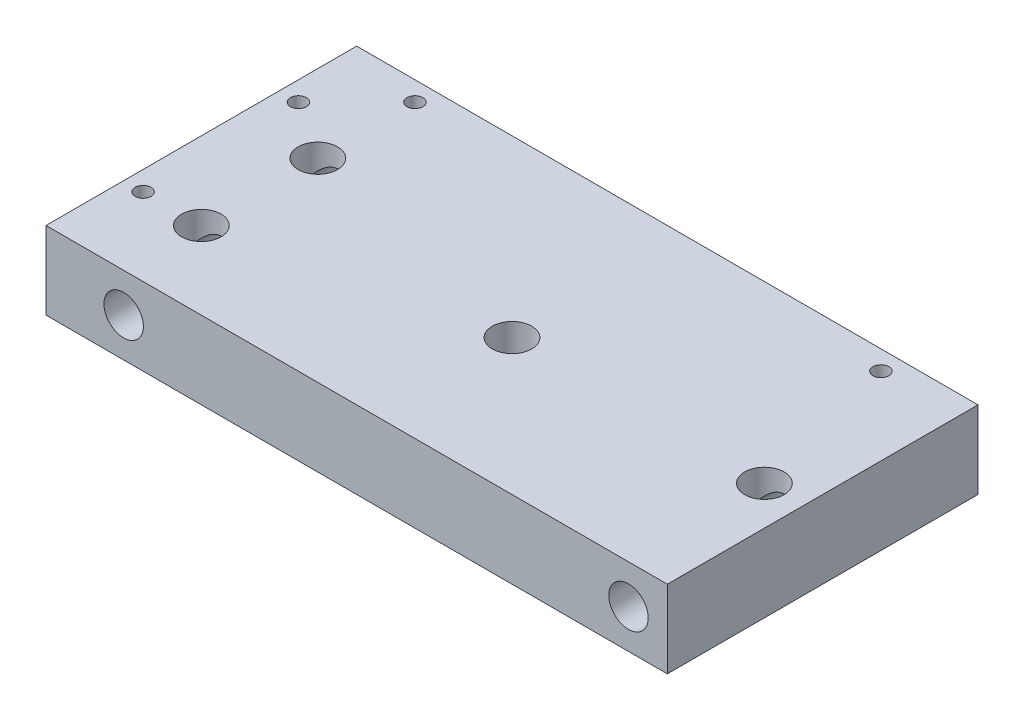
ISO-10303-21;
HEADER;
FILE_DESCRIPTION(('STEP AP214'),'2;1');
FILE_NAME('part.step','',(''),(''),'','','');
FILE_SCHEMA(('AUTOMOTIVE_DESIGN { 1 0 10303 214 1 1 1 1 }'));
ENDSEC;
DATA;
#1=APPLICATION_CONTEXT('core data for automotive mechanical design processes');
#2=APPLICATION_PROTOCOL_DEFINITION('international standard','automotive_design',2000,#1);
#3=PRODUCT_CONTEXT('',#1,'mechanical');
#4=PRODUCT('Part','Part','',(#3));
#5=PRODUCT_RELATED_PRODUCT_CATEGORY('part','',(#4));
#6=PRODUCT_DEFINITION_FORMATION('','',#4);
#7=PRODUCT_DEFINITION_CONTEXT('part definition',#1,'design');
#8=PRODUCT_DEFINITION('design','',#6,#7);
#9=PRODUCT_DEFINITION_SHAPE('','',#8);
#10=(LENGTH_UNIT() NAMED_UNIT(*) SI_UNIT(.MILLI.,.METRE.));
#11=(NAMED_UNIT(*) PLANE_ANGLE_UNIT() SI_UNIT($,.RADIAN.));
#12=(NAMED_UNIT(*) SI_UNIT($,.STERADIAN.) SOLID_ANGLE_UNIT());
#13=UNCERTAINTY_MEASURE_WITH_UNIT(LENGTH_MEASURE(1.E-05),#10,'distance_accuracy_value','');
#14=(GEOMETRIC_REPRESENTATION_CONTEXT(3) GLOBAL_UNCERTAINTY_ASSIGNED_CONTEXT((#13)) GLOBAL_UNIT_ASSIGNED_CONTEXT((#10,
#11,#12)) REPRESENTATION_CONTEXT('',''));
#15=CARTESIAN_POINT('',(0.,0.,0.));
#16=DIRECTION('',(0.,0.,1.));
#17=DIRECTION('',(1.,0.,0.));
#18=AXIS2_PLACEMENT_3D('',#15,#16,#17);
#19=CARTESIAN_POINT('',(0.,0.,0.));
#20=DIRECTION('',(0.,1.,0.));
#21=DIRECTION('',(0.,0.,1.));
#22=AXIS2_PLACEMENT_3D('',#19,#20,#21);
#23=PLANE('',#22);
#24=CARTESIAN_POINT('',(-75.,0.,-43.75));
#25=DIRECTION('',(0.,1.,0.));
#26=DIRECTION('',(0.,0.,1.));
#27=AXIS2_PLACEMENT_3D('',#24,#25,#26);
#28=CIRCLE('',#27,2.55269999999999);
#29=CARTESIAN_POINT('',(-75.,0.,-41.1973));
#30=VERTEX_POINT('',#29);
#31=EDGE_CURVE('E499',#30,#30,#28,.T.);
#32=ORIENTED_EDGE('',*,*,#31,.T.);
#33=EDGE_LOOP('',(#32));
#34=FACE_BOUND('',#33,.T.);
#35=CARTESIAN_POINT('',(75.,0.,-43.75));
#36=DIRECTION('',(0.,1.,0.));
#37=DIRECTION('',(0.,0.,1.));
#38=AXIS2_PLACEMENT_3D('',#35,#36,#37);
#39=CIRCLE('',#38,2.55269999999999);
#40=CARTESIAN_POINT('',(75.,0.,-41.1973));
#41=VERTEX_POINT('',#40);
#42=EDGE_CURVE('E504',#41,#41,#39,.T.);
#43=ORIENTED_EDGE('',*,*,#42,.T.);
#44=EDGE_LOOP('',(#43));
#45=FACE_BOUND('',#44,.T.);
#46=CARTESIAN_POINT('',(-93.75,0.,-25.));
#47=DIRECTION('',(0.,1.,0.));
#48=DIRECTION('',(0.,0.,1.));
#49=AXIS2_PLACEMENT_3D('',#46,#47,#48);
#50=CIRCLE('',#49,2.55269999999999);
#51=CARTESIAN_POINT('',(-93.75,0.,-22.4473));
#52=VERTEX_POINT('',#51);
#53=EDGE_CURVE('E508',#52,#52,#50,.T.);
#54=ORIENTED_EDGE('',*,*,#53,.T.);
#55=EDGE_LOOP('',(#54));
#56=FACE_BOUND('',#55,.T.);
#57=CARTESIAN_POINT('',(-93.75,0.,25.));
#58=DIRECTION('',(0.,1.,0.));
#59=DIRECTION('',(0.,0.,1.));
#60=AXIS2_PLACEMENT_3D('',#57,#58,#59);
#61=CIRCLE('',#60,2.55269999999999);
#62=CARTESIAN_POINT('',(-93.75,0.,27.5527));
#63=VERTEX_POINT('',#62);
#64=EDGE_CURVE('E173',#63,#63,#61,.T.);
#65=ORIENTED_EDGE('',*,*,#64,.T.);
#66=EDGE_LOOP('',(#65));
#67=FACE_BOUND('',#66,.T.);
#68=DIRECTION('',(0.,0.,-1.));
#69=VECTOR('',#68,1.);
#70=CARTESIAN_POINT('',(100.,0.,-50.));
#71=LINE('',#70,#69);
#72=CARTESIAN_POINT('',(100.,0.,50.));
#73=VERTEX_POINT('',#72);
#74=CARTESIAN_POINT('',(100.,0.,-50.));
#75=VERTEX_POINT('',#74);
#76=EDGE_CURVE('E255',#73,#75,#71,.T.);
#77=ORIENTED_EDGE('',*,*,#76,.F.);
#78=DIRECTION('',(1.,0.,0.));
#79=VECTOR('',#78,1.);
#80=CARTESIAN_POINT('',(-100.,0.,50.));
#81=LINE('',#80,#79);
#82=CARTESIAN_POINT('',(-100.,0.,50.));
#83=VERTEX_POINT('',#82);
#84=EDGE_CURVE('E262',#83,#73,#81,.T.);
#85=ORIENTED_EDGE('',*,*,#84,.F.);
#86=DIRECTION('',(0.,0.,1.));
#87=VECTOR('',#86,1.);
#88=CARTESIAN_POINT('',(-100.,0.,-50.));
#89=LINE('',#88,#87);
#90=CARTESIAN_POINT('',(-100.,0.,-50.));
#91=VERTEX_POINT('',#90);
#92=EDGE_CURVE('E273',#91,#83,#89,.T.);
#93=ORIENTED_EDGE('',*,*,#92,.F.);
#94=DIRECTION('',(-1.,0.,0.));
#95=VECTOR('',#94,1.);
#96=CARTESIAN_POINT('',(-100.,0.,-50.));
#97=LINE('',#96,#95);
#98=EDGE_CURVE('E271',#75,#91,#97,.T.);
#99=ORIENTED_EDGE('',*,*,#98,.F.);
#100=EDGE_LOOP('',(#77,#85,#93,#99));
#101=FACE_BOUND('',#100,.T.);
#102=DIRECTION('',(0.,0.,-1.));
#103=VECTOR('',#102,1.);
#104=CARTESIAN_POINT('',(9.42500000000001,0.,0.));
#105=LINE('',#104,#103);
#106=CARTESIAN_POINT('',(9.42500000000001,0.,18.2561024882961));
#107=VERTEX_POINT('',#106);
#108=CARTESIAN_POINT('',(9.42500000000001,0.,11.7492613140312));
#109=VERTEX_POINT('',#108);
#110=EDGE_CURVE('E151',#107,#109,#105,.T.);
#111=ORIENTED_EDGE('',*,*,#110,.T.);
#112=CARTESIAN_POINT('',(6.25000000000001,0.,6.25));
#113=DIRECTION('',(0.,1.,0.));
#114=DIRECTION('',(0.,0.,1.));
#115=AXIS2_PLACEMENT_3D('',#112,#113,#114);
#116=CIRCLE('',#115,6.35);
#117=CARTESIAN_POINT('',(9.42500000000001,0.,0.750738685968814));
#118=VERTEX_POINT('',#117);
#119=EDGE_CURVE('E213',#118,#109,#116,.F.);
#120=ORIENTED_EDGE('',*,*,#119,.F.);
#121=DIRECTION('',(0.,0.,-1.));
#122=VECTOR('',#121,1.);
#123=CARTESIAN_POINT('',(9.42500000000001,0.,0.));
#124=LINE('',#123,#122);
#125=CARTESIAN_POINT('',(9.42500000000001,0.,-7.14389751170388));
#126=VERTEX_POINT('',#125);
#127=EDGE_CURVE('E187',#118,#126,#124,.T.);
#128=ORIENTED_EDGE('',*,*,#127,.T.);
#129=CARTESIAN_POINT('',(6.25000000000001,0.,-7.14389751170388));
#130=DIRECTION('',(0.,-1.,0.));
#131=DIRECTION('',(0.,0.,-1.));
#132=AXIS2_PLACEMENT_3D('',#129,#130,#131);
#133=CIRCLE('',#132,3.175);
#134=CARTESIAN_POINT('',(3.075,0.,-7.14389751170388));
#135=VERTEX_POINT('',#134);
#136=EDGE_CURVE('E195',#135,#126,#133,.T.);
#137=ORIENTED_EDGE('',*,*,#136,.F.);
#138=DIRECTION('',(0.,0.,-1.));
#139=VECTOR('',#138,1.);
#140=CARTESIAN_POINT('',(3.075,0.,0.));
#141=LINE('',#140,#139);
#142=CARTESIAN_POINT('',(3.075,0.,0.750738685968814));
#143=VERTEX_POINT('',#142);
#144=EDGE_CURVE('E178',#143,#135,#141,.T.);
#145=ORIENTED_EDGE('',*,*,#144,.F.);
#146=CARTESIAN_POINT('',(3.075,0.,11.7492613140312));
#147=VERTEX_POINT('',#146);
#148=EDGE_CURVE('E212',#147,#143,#116,.F.);
#149=ORIENTED_EDGE('',*,*,#148,.F.);
#150=DIRECTION('',(0.,0.,-1.));
#151=VECTOR('',#150,1.);
#152=CARTESIAN_POINT('',(3.075,0.,0.));
#153=LINE('',#152,#151);
#154=CARTESIAN_POINT('',(3.075,0.,18.2561024882961));
#155=VERTEX_POINT('',#154);
#156=EDGE_CURVE('E163',#155,#147,#153,.T.);
#157=ORIENTED_EDGE('',*,*,#156,.F.);
#158=CARTESIAN_POINT('',(6.25000000000001,0.,18.2561024882961));
#159=DIRECTION('',(0.,-1.,0.));
#160=DIRECTION('',(0.,0.,-1.));
#161=AXIS2_PLACEMENT_3D('',#158,#159,#160);
#162=CIRCLE('',#161,3.175);
#163=EDGE_CURVE('E172',#107,#155,#162,.T.);
#164=ORIENTED_EDGE('',*,*,#163,.F.);
#165=EDGE_LOOP('',(#111,#120,#128,#137,#145,#149,#157,#164));
#166=FACE_BOUND('',#165,.T.);
#167=ADVANCED_FACE('F37',(#34,#45,#56,#67,#101,#166),#23,.F.);
#168=CARTESIAN_POINT('',(6.25000000000001,-0.001000000000001,6.25));
#169=DIRECTION('',(0.,1.,0.));
#170=DIRECTION('',(0.,0.,1.));
#171=AXIS2_PLACEMENT_3D('',#168,#169,#170);
#172=CYLINDRICAL_SURFACE('',#171,6.35);
#173=CARTESIAN_POINT('',(6.25000000000001,25.,6.25));
#174=DIRECTION('',(0.,1.,0.));
#175=DIRECTION('',(0.,0.,1.));
#176=AXIS2_PLACEMENT_3D('',#173,#174,#175);
#177=CIRCLE('',#176,6.35);
#178=CARTESIAN_POINT('',(6.25000000000001,25.,12.6));
#179=VERTEX_POINT('',#178);
#180=EDGE_CURVE('E203',#179,#179,#177,.T.);
#181=ORIENTED_EDGE('',*,*,#180,.T.);
#182=EDGE_LOOP('',(#181));
#183=FACE_BOUND('',#182,.T.);
#184=DIRECTION('',(0.,-1.,0.));
#185=VECTOR('',#184,1.);
#186=CARTESIAN_POINT('',(9.42500000000001,6.35,11.7492613140312));
#187=LINE('',#186,#185);
#188=CARTESIAN_POINT('',(9.42500000000001,6.35,11.7492613140312));
#189=VERTEX_POINT('',#188);
#190=EDGE_CURVE('E176',#189,#109,#187,.T.);
#191=ORIENTED_EDGE('',*,*,#190,.F.);
#192=CARTESIAN_POINT('',(6.25000000000001,6.35,6.25));
#193=DIRECTION('',(0.,-1.,0.));
#194=DIRECTION('',(0.,0.,-1.));
#195=AXIS2_PLACEMENT_3D('',#192,#193,#194);
#196=CIRCLE('',#195,6.35);
#197=CARTESIAN_POINT('',(3.075,6.35,11.7492613140312));
#198=VERTEX_POINT('',#197);
#199=EDGE_CURVE('E157',#198,#189,#196,.F.);
#200=ORIENTED_EDGE('',*,*,#199,.F.);
#201=DIRECTION('',(0.,-1.,0.));
#202=VECTOR('',#201,1.);
#203=CARTESIAN_POINT('',(3.075,6.35,11.7492613140312));
#204=LINE('',#203,#202);
#205=EDGE_CURVE('E179',#198,#147,#204,.T.);
#206=ORIENTED_EDGE('',*,*,#205,.T.);
#207=ORIENTED_EDGE('',*,*,#148,.T.);
#208=DIRECTION('',(0.,-1.,0.));
#209=VECTOR('',#208,1.);
#210=CARTESIAN_POINT('',(3.075,6.35,0.750738685968814));
#211=LINE('',#210,#209);
#212=CARTESIAN_POINT('',(3.075,6.35,0.750738685968814));
#213=VERTEX_POINT('',#212);
#214=EDGE_CURVE('E200',#213,#143,#211,.T.);
#215=ORIENTED_EDGE('',*,*,#214,.F.);
#216=CARTESIAN_POINT('',(6.25000000000001,6.35,6.25));
#217=DIRECTION('',(0.,-1.,0.));
#218=DIRECTION('',(0.,0.,-1.));
#219=AXIS2_PLACEMENT_3D('',#216,#217,#218);
#220=CIRCLE('',#219,6.35);
#221=CARTESIAN_POINT('',(9.42500000000001,6.35,0.750738685968814));
#222=VERTEX_POINT('',#221);
#223=EDGE_CURVE('E190',#222,#213,#220,.F.);
#224=ORIENTED_EDGE('',*,*,#223,.F.);
#225=DIRECTION('',(0.,-1.,0.));
#226=VECTOR('',#225,1.);
#227=CARTESIAN_POINT('',(9.42500000000001,6.35,0.750738685968814));
#228=LINE('',#227,#226);
#229=EDGE_CURVE('E204',#222,#118,#228,.T.);
#230=ORIENTED_EDGE('',*,*,#229,.T.);
#231=ORIENTED_EDGE('',*,*,#119,.T.);
#232=EDGE_LOOP('',(#191,#200,#206,#207,#215,#224,#230,#231));
#233=FACE_BOUND('',#232,.T.);
#234=ADVANCED_FACE('F317',(#183,#233),#172,.F.);
#235=CARTESIAN_POINT('',(87.500000108,12.5,-37.5));
#236=DIRECTION('',(0.,0.,1.));
#237=DIRECTION('',(1.,0.,0.));
#238=AXIS2_PLACEMENT_3D('',#235,#236,#237);
#239=CYLINDRICAL_SURFACE('',#238,6.35);
#240=CARTESIAN_POINT('',(87.500000108,12.5,50.));
#241=DIRECTION('',(0.,0.,1.));
#242=DIRECTION('',(1.,0.,0.));
#243=AXIS2_PLACEMENT_3D('',#240,#241,#242);
#244=CIRCLE('',#243,6.35);
#245=CARTESIAN_POINT('',(93.850000108,12.5,50.));
#246=VERTEX_POINT('',#245);
#247=EDGE_CURVE('E243',#246,#246,#244,.T.);
#248=ORIENTED_EDGE('',*,*,#247,.T.);
#249=EDGE_LOOP('',(#248));
#250=FACE_BOUND('',#249,.T.);
#251=CARTESIAN_POINT('',(87.500000108,12.5,6.25));
#252=DIRECTION('',(0.,-0.707106781186547,0.707106781186547));
#253=DIRECTION('',(0.,0.707106781186547,0.707106781186547));
#254=AXIS2_PLACEMENT_3D('',#251,#252,#253);
#255=ELLIPSE('',#254,8.98025612106915,6.35);
#256=CARTESIAN_POINT('',(81.150000108,12.5,6.25));
#257=VERTEX_POINT('',#256);
#258=CARTESIAN_POINT('',(93.850000108,12.5,6.25));
#259=VERTEX_POINT('',#258);
#260=EDGE_CURVE('E298',#257,#259,#255,.F.);
#261=ORIENTED_EDGE('',*,*,#260,.T.);
#262=CARTESIAN_POINT('',(87.500000108,12.5,6.25));
#263=DIRECTION('',(0.,0.707106781186547,0.707106781186547));
#264=DIRECTION('',(0.,-0.707106781186547,0.707106781186547));
#265=AXIS2_PLACEMENT_3D('',#262,#263,#264);
#266=ELLIPSE('',#265,8.98025612106915,6.35);
#267=EDGE_CURVE('E11',#259,#257,#266,.F.);
#268=ORIENTED_EDGE('',*,*,#267,.T.);
#269=EDGE_LOOP('',(#261,#268));
#270=FACE_BOUND('',#269,.T.);
#271=ADVANCED_FACE('F314',(#250,#270),#239,.F.);
#272=CARTESIAN_POINT('',(-75.,12.5,-37.5));
#273=DIRECTION('',(0.,0.,1.));
#274=DIRECTION('',(1.,0.,0.));
#275=AXIS2_PLACEMENT_3D('',#272,#273,#274);
#276=CYLINDRICAL_SURFACE('',#275,6.35);
#277=CARTESIAN_POINT('',(-75.,12.5,50.));
#278=DIRECTION('',(0.,0.,1.));
#279=DIRECTION('',(1.,0.,0.));
#280=AXIS2_PLACEMENT_3D('',#277,#278,#279);
#281=CIRCLE('',#280,6.35);
#282=CARTESIAN_POINT('',(-68.65,12.5,50.));
#283=VERTEX_POINT('',#282);
#284=EDGE_CURVE('E249',#283,#283,#281,.T.);
#285=ORIENTED_EDGE('',*,*,#284,.T.);
#286=EDGE_LOOP('',(#285));
#287=FACE_BOUND('',#286,.T.);
#288=CARTESIAN_POINT('',(-75.,12.5,25.));
#289=DIRECTION('',(0.,-0.707106781186547,0.707106781186547));
#290=DIRECTION('',(0.,0.707106781186547,0.707106781186547));
#291=AXIS2_PLACEMENT_3D('',#288,#289,#290);
#292=ELLIPSE('',#291,8.98025612106915,6.35);
#293=CARTESIAN_POINT('',(-81.35,12.5,25.));
#294=VERTEX_POINT('',#293);
#295=CARTESIAN_POINT('',(-68.65,12.5,25.));
#296=VERTEX_POINT('',#295);
#297=EDGE_CURVE('E226',#294,#296,#292,.F.);
#298=ORIENTED_EDGE('',*,*,#297,.T.);
#299=CARTESIAN_POINT('',(-75.,12.5,25.));
#300=DIRECTION('',(0.,0.707106781186547,0.707106781186547));
#301=DIRECTION('',(0.,-0.707106781186547,0.707106781186547));
#302=AXIS2_PLACEMENT_3D('',#299,#300,#301);
#303=ELLIPSE('',#302,8.98025612106915,6.35);
#304=EDGE_CURVE('E236',#296,#294,#303,.F.);
#305=ORIENTED_EDGE('',*,*,#304,.T.);
#306=EDGE_LOOP('',(#298,#305));
#307=FACE_BOUND('',#306,.T.);
#308=ADVANCED_FACE('F316',(#287,#307),#276,.F.);
#309=CARTESIAN_POINT('',(-75.,12.5,25.));
#310=DIRECTION('',(0.,-0.707106781186547,0.707106781186547));
#311=DIRECTION('',(0.,0.707106781186547,0.707106781186547));
#312=AXIS2_PLACEMENT_3D('',#309,#310,#311);
#313=ELLIPSE('',#312,8.98025612106915,6.35);
#314=EDGE_CURVE('E230',#294,#296,#313,.T.);
#315=ORIENTED_EDGE('',*,*,#314,.T.);
#316=CARTESIAN_POINT('',(-75.,12.5,25.));
#317=DIRECTION('',(0.,0.707106781186547,0.707106781186547));
#318=DIRECTION('',(0.,-0.707106781186547,0.707106781186547));
#319=AXIS2_PLACEMENT_3D('',#316,#317,#318);
#320=ELLIPSE('',#319,8.98025612106915,6.35);
#321=EDGE_CURVE('E233',#296,#294,#320,.T.);
#322=ORIENTED_EDGE('',*,*,#321,.T.);
#323=EDGE_LOOP('',(#315,#322));
#324=FACE_BOUND('',#323,.T.);
#325=CARTESIAN_POINT('',(-75.,12.5,-12.5));
#326=DIRECTION('',(0.,-0.707106781186547,0.707106781186547));
#327=DIRECTION('',(0.,0.707106781186547,0.707106781186547));
#328=AXIS2_PLACEMENT_3D('',#325,#326,#327);
#329=ELLIPSE('',#328,8.98025612106915,6.35);
#330=CARTESIAN_POINT('',(-81.35,12.5,-12.5));
#331=VERTEX_POINT('',#330);
#332=CARTESIAN_POINT('',(-68.65,12.5,-12.5));
#333=VERTEX_POINT('',#332);
#334=EDGE_CURVE('E287',#331,#333,#329,.F.);
#335=ORIENTED_EDGE('',*,*,#334,.T.);
#336=CARTESIAN_POINT('',(-75.,12.5,-12.5));
#337=DIRECTION('',(0.,0.707106781186547,0.707106781186547));
#338=DIRECTION('',(0.,-0.707106781186547,0.707106781186547));
#339=AXIS2_PLACEMENT_3D('',#336,#337,#338);
#340=ELLIPSE('',#339,8.98025612106915,6.35);
#341=EDGE_CURVE('E295',#333,#331,#340,.F.);
#342=ORIENTED_EDGE('',*,*,#341,.T.);
#343=EDGE_LOOP('',(#335,#342));
#344=FACE_BOUND('',#343,.T.);
#345=ADVANCED_FACE('F324',(#324,#344),#276,.F.);
#346=CARTESIAN_POINT('',(100.,25.,-50.));
#347=DIRECTION('',(-1.,0.,0.));
#348=DIRECTION('',(0.,0.,1.));
#349=AXIS2_PLACEMENT_3D('',#346,#347,#348);
#350=PLANE('',#349);
#351=ORIENTED_EDGE('',*,*,#76,.T.);
#352=DIRECTION('',(0.,-1.,0.));
#353=VECTOR('',#352,1.);
#354=CARTESIAN_POINT('',(100.,25.,-50.));
#355=LINE('',#354,#353);
#356=CARTESIAN_POINT('',(100.,25.,-50.));
#357=VERTEX_POINT('',#356);
#358=EDGE_CURVE('E284',#357,#75,#355,.T.);
#359=ORIENTED_EDGE('',*,*,#358,.F.);
#360=DIRECTION('',(0.,0.,-1.));
#361=VECTOR('',#360,1.);
#362=CARTESIAN_POINT('',(100.,25.,-50.));
#363=LINE('',#362,#361);
#364=CARTESIAN_POINT('',(100.,25.,50.));
#365=VERTEX_POINT('',#364);
#366=EDGE_CURVE('E258',#365,#357,#363,.T.);
#367=ORIENTED_EDGE('',*,*,#366,.F.);
#368=DIRECTION('',(0.,-1.,0.));
#369=VECTOR('',#368,1.);
#370=CARTESIAN_POINT('',(100.,25.,50.));
#371=LINE('',#370,#369);
#372=EDGE_CURVE('E268',#365,#73,#371,.T.);
#373=ORIENTED_EDGE('',*,*,#372,.T.);
#374=EDGE_LOOP('',(#351,#359,#367,#373));
#375=FACE_BOUND('',#374,.T.);
#376=ADVANCED_FACE('F39',(#375),#350,.F.);
#377=CARTESIAN_POINT('',(-100.,25.,-50.));
#378=DIRECTION('',(0.,0.,1.));
#379=DIRECTION('',(1.,0.,0.));
#380=AXIS2_PLACEMENT_3D('',#377,#378,#379);
#381=PLANE('',#380);
#382=ORIENTED_EDGE('',*,*,#98,.T.);
#383=DIRECTION('',(0.,-1.,0.));
#384=VECTOR('',#383,1.);
#385=CARTESIAN_POINT('',(-100.,25.,-50.));
#386=LINE('',#385,#384);
#387=CARTESIAN_POINT('',(-100.,25.,-50.));
#388=VERTEX_POINT('',#387);
#389=EDGE_CURVE('E281',#388,#91,#386,.T.);
#390=ORIENTED_EDGE('',*,*,#389,.F.);
#391=DIRECTION('',(-1.,0.,0.));
#392=VECTOR('',#391,1.);
#393=CARTESIAN_POINT('',(-100.,25.,-50.));
#394=LINE('',#393,#392);
#395=EDGE_CURVE('E261',#357,#388,#394,.T.);
#396=ORIENTED_EDGE('',*,*,#395,.F.);
#397=ORIENTED_EDGE('',*,*,#358,.T.);
#398=EDGE_LOOP('',(#382,#390,#396,#397));
#399=FACE_BOUND('',#398,.T.);
#400=ADVANCED_FACE('F353',(#399),#381,.F.);
#401=CARTESIAN_POINT('',(-100.,25.,-50.));
#402=DIRECTION('',(1.,0.,0.));
#403=DIRECTION('',(0.,0.,-1.));
#404=AXIS2_PLACEMENT_3D('',#401,#402,#403);
#405=PLANE('',#404);
#406=ORIENTED_EDGE('',*,*,#92,.T.);
#407=DIRECTION('',(0.,-1.,0.));
#408=VECTOR('',#407,1.);
#409=CARTESIAN_POINT('',(-100.,25.,50.));
#410=LINE('',#409,#408);
#411=CARTESIAN_POINT('',(-100.,25.,50.));
#412=VERTEX_POINT('',#411);
#413=EDGE_CURVE('E278',#412,#83,#410,.T.);
#414=ORIENTED_EDGE('',*,*,#413,.F.);
#415=DIRECTION('',(0.,0.,1.));
#416=VECTOR('',#415,1.);
#417=CARTESIAN_POINT('',(-100.,25.,-50.));
#418=LINE('',#417,#416);
#419=EDGE_CURVE('E264',#388,#412,#418,.T.);
#420=ORIENTED_EDGE('',*,*,#419,.F.);
#421=ORIENTED_EDGE('',*,*,#389,.T.);
#422=EDGE_LOOP('',(#406,#414,#420,#421));
#423=FACE_BOUND('',#422,.T.);
#424=ADVANCED_FACE('F350',(#423),#405,.F.);
#425=CARTESIAN_POINT('',(-100.,25.,50.));
#426=DIRECTION('',(0.,0.,-1.));
#427=DIRECTION('',(-1.,0.,0.));
#428=AXIS2_PLACEMENT_3D('',#425,#426,#427);
#429=PLANE('',#428);
#430=ORIENTED_EDGE('',*,*,#247,.F.);
#431=EDGE_LOOP('',(#430));
#432=FACE_BOUND('',#431,.T.);
#433=ORIENTED_EDGE('',*,*,#284,.F.);
#434=EDGE_LOOP('',(#433));
#435=FACE_BOUND('',#434,.T.);
#436=ORIENTED_EDGE('',*,*,#84,.T.);
#437=ORIENTED_EDGE('',*,*,#372,.F.);
#438=DIRECTION('',(1.,0.,0.));
#439=VECTOR('',#438,1.);
#440=CARTESIAN_POINT('',(-100.,25.,50.));
#441=LINE('',#440,#439);
#442=EDGE_CURVE('E266',#412,#365,#441,.T.);
#443=ORIENTED_EDGE('',*,*,#442,.F.);
#444=ORIENTED_EDGE('',*,*,#413,.T.);
#445=EDGE_LOOP('',(#436,#437,#443,#444));
#446=FACE_BOUND('',#445,.T.);
#447=ADVANCED_FACE('F347',(#432,#435,#446),#429,.F.);
#448=CARTESIAN_POINT('',(0.,25.,0.));
#449=DIRECTION('',(0.,1.,0.));
#450=DIRECTION('',(0.,0.,1.));
#451=AXIS2_PLACEMENT_3D('',#448,#449,#450);
#452=PLANE('',#451);
#453=CARTESIAN_POINT('',(-75.,25.,-43.75));
#454=DIRECTION('',(0.,1.,0.));
#455=DIRECTION('',(0.,0.,1.));
#456=AXIS2_PLACEMENT_3D('',#453,#454,#455);
#457=CIRCLE('',#456,2.55269999999999);
#458=CARTESIAN_POINT('',(-75.,25.,-41.1973));
#459=VERTEX_POINT('',#458);
#460=EDGE_CURVE('E387',#459,#459,#457,.T.);
#461=ORIENTED_EDGE('',*,*,#460,.F.);
#462=EDGE_LOOP('',(#461));
#463=FACE_BOUND('',#462,.T.);
#464=CARTESIAN_POINT('',(75.,25.,-43.75));
#465=DIRECTION('',(0.,1.,0.));
#466=DIRECTION('',(0.,0.,1.));
#467=AXIS2_PLACEMENT_3D('',#464,#465,#466);
#468=CIRCLE('',#467,2.55269999999999);
#469=CARTESIAN_POINT('',(75.,25.,-41.1973));
#470=VERTEX_POINT('',#469);
#471=EDGE_CURVE('E391',#470,#470,#468,.T.);
#472=ORIENTED_EDGE('',*,*,#471,.F.);
#473=EDGE_LOOP('',(#472));
#474=FACE_BOUND('',#473,.T.);
#475=CARTESIAN_POINT('',(-93.75,25.,-25.));
#476=DIRECTION('',(0.,1.,0.));
#477=DIRECTION('',(0.,0.,1.));
#478=AXIS2_PLACEMENT_3D('',#475,#476,#477);
#479=CIRCLE('',#478,2.55269999999999);
#480=CARTESIAN_POINT('',(-93.75,25.,-22.4473));
#481=VERTEX_POINT('',#480);
#482=EDGE_CURVE('E395',#481,#481,#479,.T.);
#483=ORIENTED_EDGE('',*,*,#482,.F.);
#484=EDGE_LOOP('',(#483));
#485=FACE_BOUND('',#484,.T.);
#486=CARTESIAN_POINT('',(-93.75,25.,25.));
#487=DIRECTION('',(0.,1.,0.));
#488=DIRECTION('',(0.,0.,1.));
#489=AXIS2_PLACEMENT_3D('',#486,#487,#488);
#490=CIRCLE('',#489,2.55269999999999);
#491=CARTESIAN_POINT('',(-93.75,25.,27.5527));
#492=VERTEX_POINT('',#491);
#493=EDGE_CURVE('E399',#492,#492,#490,.T.);
#494=ORIENTED_EDGE('',*,*,#493,.F.);
#495=EDGE_LOOP('',(#494));
#496=FACE_BOUND('',#495,.T.);
#497=ORIENTED_EDGE('',*,*,#180,.F.);
#498=EDGE_LOOP('',(#497));
#499=FACE_BOUND('',#498,.T.);
#500=CARTESIAN_POINT('',(87.500000108,25.,6.25));
#501=DIRECTION('',(0.,1.,0.));
#502=DIRECTION('',(0.,0.,1.));
#503=AXIS2_PLACEMENT_3D('',#500,#501,#502);
#504=CIRCLE('',#503,6.35);
#505=CARTESIAN_POINT('',(87.500000108,25.,12.6));
#506=VERTEX_POINT('',#505);
#507=EDGE_CURVE('E216',#506,#506,#504,.T.);
#508=ORIENTED_EDGE('',*,*,#507,.F.);
#509=EDGE_LOOP('',(#508));
#510=FACE_BOUND('',#509,.T.);
#511=CARTESIAN_POINT('',(-75.,25.,25.));
#512=DIRECTION('',(0.,1.,0.));
#513=DIRECTION('',(0.,0.,1.));
#514=AXIS2_PLACEMENT_3D('',#511,#512,#513);
#515=CIRCLE('',#514,6.35);
#516=CARTESIAN_POINT('',(-75.,25.,31.35));
#517=VERTEX_POINT('',#516);
#518=EDGE_CURVE('E220',#517,#517,#515,.T.);
#519=ORIENTED_EDGE('',*,*,#518,.F.);
#520=EDGE_LOOP('',(#519));
#521=FACE_BOUND('',#520,.T.);
#522=CARTESIAN_POINT('',(-75.,25.,-12.5));
#523=DIRECTION('',(0.,1.,0.));
#524=DIRECTION('',(0.,0.,1.));
#525=AXIS2_PLACEMENT_3D('',#522,#523,#524);
#526=CIRCLE('',#525,6.35);
#527=CARTESIAN_POINT('',(-75.,25.,-6.14999999999999));
#528=VERTEX_POINT('',#527);
#529=EDGE_CURVE('E239',#528,#528,#526,.T.);
#530=ORIENTED_EDGE('',*,*,#529,.F.);
#531=EDGE_LOOP('',(#530));
#532=FACE_BOUND('',#531,.T.);
#533=ORIENTED_EDGE('',*,*,#366,.T.);
#534=ORIENTED_EDGE('',*,*,#395,.T.);
#535=ORIENTED_EDGE('',*,*,#419,.T.);
#536=ORIENTED_EDGE('',*,*,#442,.T.);
#537=EDGE_LOOP('',(#533,#534,#535,#536));
#538=FACE_BOUND('',#537,.T.);
#539=ADVANCED_FACE('F346',(#463,#474,#485,#496,#499,#510,#521,#532,#538),#452,.T.);
#540=CARTESIAN_POINT('',(-75.,6.,-12.5));
#541=DIRECTION('',(0.,1.,0.));
#542=DIRECTION('',(0.,0.,1.));
#543=AXIS2_PLACEMENT_3D('',#540,#541,#542);
#544=CYLINDRICAL_SURFACE('',#543,6.35);
#545=ORIENTED_EDGE('',*,*,#529,.T.);
#546=EDGE_LOOP('',(#545));
#547=FACE_BOUND('',#546,.T.);
#548=ORIENTED_EDGE('',*,*,#334,.F.);
#549=CARTESIAN_POINT('',(-75.,12.5,-12.5));
#550=DIRECTION('',(0.,0.707106781186547,0.707106781186547));
#551=DIRECTION('',(0.,-0.707106781186547,0.707106781186547));
#552=AXIS2_PLACEMENT_3D('',#549,#550,#551);
#553=ELLIPSE('',#552,8.98025612106915,6.35);
#554=EDGE_CURVE('E292',#333,#331,#553,.T.);
#555=ORIENTED_EDGE('',*,*,#554,.F.);
#556=EDGE_LOOP('',(#548,#555));
#557=FACE_BOUND('',#556,.T.);
#558=ADVANCED_FACE('F375',(#547,#557),#544,.F.);
#559=CARTESIAN_POINT('',(-75.,12.5,-37.5));
#560=DIRECTION('',(0.,0.,1.));
#561=DIRECTION('',(1.,0.,0.));
#562=AXIS2_PLACEMENT_3D('',#559,#560,#561);
#563=PLANE('',#562);
#564=CARTESIAN_POINT('',(-75.,12.5,-37.5));
#565=DIRECTION('',(0.,0.,1.));
#566=DIRECTION('',(1.,0.,0.));
#567=AXIS2_PLACEMENT_3D('',#564,#565,#566);
#568=CIRCLE('',#567,6.35);
#569=CARTESIAN_POINT('',(-68.65,12.5,-37.5));
#570=VERTEX_POINT('',#569);
#571=EDGE_CURVE('E252',#570,#570,#568,.T.);
#572=ORIENTED_EDGE('',*,*,#571,.T.);
#573=EDGE_LOOP('',(#572));
#574=FACE_BOUND('',#573,.T.);
#575=ADVANCED_FACE('F380',(#574),#563,.T.);
#576=CARTESIAN_POINT('',(-75.,12.5,-12.5));
#577=DIRECTION('',(0.,-0.707106781186547,0.707106781186547));
#578=DIRECTION('',(0.,0.707106781186547,0.707106781186547));
#579=AXIS2_PLACEMENT_3D('',#576,#577,#578);
#580=ELLIPSE('',#579,8.98025612106915,6.35);
#581=EDGE_CURVE('E289',#331,#333,#580,.T.);
#582=ORIENTED_EDGE('',*,*,#581,.T.);
#583=ORIENTED_EDGE('',*,*,#554,.T.);
#584=EDGE_LOOP('',(#582,#583));
#585=FACE_BOUND('',#584,.T.);
#586=ORIENTED_EDGE('',*,*,#571,.F.);
#587=EDGE_LOOP('',(#586));
#588=FACE_BOUND('',#587,.T.);
#589=ADVANCED_FACE('F327',(#585,#588),#276,.F.);
#590=CARTESIAN_POINT('',(-75.,6.,-12.5));
#591=DIRECTION('',(0.,1.,0.));
#592=DIRECTION('',(0.,0.,1.));
#593=AXIS2_PLACEMENT_3D('',#590,#591,#592);
#594=CIRCLE('',#593,6.35);
#595=CARTESIAN_POINT('',(-75.,6.,-6.14999999999999));
#596=VERTEX_POINT('',#595);
#597=EDGE_CURVE('E240',#596,#596,#594,.T.);
#598=ORIENTED_EDGE('',*,*,#597,.F.);
#599=EDGE_LOOP('',(#598));
#600=FACE_BOUND('',#599,.T.);
#601=ORIENTED_EDGE('',*,*,#581,.F.);
#602=ORIENTED_EDGE('',*,*,#341,.F.);
#603=EDGE_LOOP('',(#601,#602));
#604=FACE_BOUND('',#603,.T.);
#605=ADVANCED_FACE('F383',(#600,#604),#544,.F.);
#606=CARTESIAN_POINT('',(0.,6.,0.));
#607=DIRECTION('',(0.,1.,0.));
#608=DIRECTION('',(0.,0.,1.));
#609=AXIS2_PLACEMENT_3D('',#606,#607,#608);
#610=PLANE('',#609);
#611=ORIENTED_EDGE('',*,*,#597,.T.);
#612=EDGE_LOOP('',(#611));
#613=FACE_BOUND('',#612,.T.);
#614=ADVANCED_FACE('F416',(#613),#610,.T.);
#615=CARTESIAN_POINT('',(-75.,6.,25.));
#616=DIRECTION('',(0.,1.,0.));
#617=DIRECTION('',(0.,0.,1.));
#618=AXIS2_PLACEMENT_3D('',#615,#616,#617);
#619=CYLINDRICAL_SURFACE('',#618,6.35);
#620=ORIENTED_EDGE('',*,*,#518,.T.);
#621=EDGE_LOOP('',(#620));
#622=FACE_BOUND('',#621,.T.);
#623=ORIENTED_EDGE('',*,*,#297,.F.);
#624=ORIENTED_EDGE('',*,*,#321,.F.);
#625=EDGE_LOOP('',(#623,#624));
#626=FACE_BOUND('',#625,.T.);
#627=ADVANCED_FACE('F422',(#622,#626),#619,.F.);
#628=CARTESIAN_POINT('',(-75.,6.,25.));
#629=DIRECTION('',(0.,1.,0.));
#630=DIRECTION('',(0.,0.,1.));
#631=AXIS2_PLACEMENT_3D('',#628,#629,#630);
#632=CIRCLE('',#631,6.35);
#633=CARTESIAN_POINT('',(-75.,6.,31.35));
#634=VERTEX_POINT('',#633);
#635=EDGE_CURVE('E223',#634,#634,#632,.T.);
#636=ORIENTED_EDGE('',*,*,#635,.F.);
#637=EDGE_LOOP('',(#636));
#638=FACE_BOUND('',#637,.T.);
#639=ORIENTED_EDGE('',*,*,#314,.F.);
#640=ORIENTED_EDGE('',*,*,#304,.F.);
#641=EDGE_LOOP('',(#639,#640));
#642=FACE_BOUND('',#641,.T.);
#643=ADVANCED_FACE('F439',(#638,#642),#619,.F.);
#644=CARTESIAN_POINT('',(0.,6.,0.));
#645=DIRECTION('',(0.,1.,0.));
#646=DIRECTION('',(0.,0.,1.));
#647=AXIS2_PLACEMENT_3D('',#644,#645,#646);
#648=PLANE('',#647);
#649=ORIENTED_EDGE('',*,*,#635,.T.);
#650=EDGE_LOOP('',(#649));
#651=FACE_BOUND('',#650,.T.);
#652=ADVANCED_FACE('F432',(#651),#648,.T.);
#653=CARTESIAN_POINT('',(87.500000108,6.,6.25));
#654=DIRECTION('',(0.,1.,0.));
#655=DIRECTION('',(0.,0.,1.));
#656=AXIS2_PLACEMENT_3D('',#653,#654,#655);
#657=CYLINDRICAL_SURFACE('',#656,6.35);
#658=ORIENTED_EDGE('',*,*,#507,.T.);
#659=EDGE_LOOP('',(#658));
#660=FACE_BOUND('',#659,.T.);
#661=ORIENTED_EDGE('',*,*,#260,.F.);
#662=CARTESIAN_POINT('',(87.500000108,12.5,6.25));
#663=DIRECTION('',(0.,0.707106781186547,0.707106781186547));
#664=DIRECTION('',(0.,-0.707106781186547,0.707106781186547));
#665=AXIS2_PLACEMENT_3D('',#662,#663,#664);
#666=ELLIPSE('',#665,8.98025612106915,6.35);
#667=EDGE_CURVE('E45',#259,#257,#666,.T.);
#668=ORIENTED_EDGE('',*,*,#667,.F.);
#669=EDGE_LOOP('',(#661,#668));
#670=FACE_BOUND('',#669,.T.);
#671=ADVANCED_FACE('F310',(#660,#670),#657,.F.);
#672=CARTESIAN_POINT('',(87.500000108,12.5,-37.5));
#673=DIRECTION('',(0.,0.,1.));
#674=DIRECTION('',(1.,0.,0.));
#675=AXIS2_PLACEMENT_3D('',#672,#673,#674);
#676=PLANE('',#675);
#677=CARTESIAN_POINT('',(87.500000108,12.5,-37.5));
#678=DIRECTION('',(0.,0.,1.));
#679=DIRECTION('',(1.,0.,0.));
#680=AXIS2_PLACEMENT_3D('',#677,#678,#679);
#681=CIRCLE('',#680,6.35);
#682=CARTESIAN_POINT('',(93.850000108,12.5,-37.5));
#683=VERTEX_POINT('',#682);
#684=EDGE_CURVE('E246',#683,#683,#681,.T.);
#685=ORIENTED_EDGE('',*,*,#684,.T.);
#686=EDGE_LOOP('',(#685));
#687=FACE_BOUND('',#686,.T.);
#688=ADVANCED_FACE('F334',(#687),#676,.T.);
#689=CARTESIAN_POINT('',(87.500000108,12.5,6.25));
#690=DIRECTION('',(0.,-0.707106781186547,0.707106781186547));
#691=DIRECTION('',(0.,0.707106781186547,0.707106781186547));
#692=AXIS2_PLACEMENT_3D('',#689,#690,#691);
#693=ELLIPSE('',#692,8.98025612106915,6.35);
#694=EDGE_CURVE('E300',#257,#259,#693,.T.);
#695=ORIENTED_EDGE('',*,*,#694,.T.);
#696=ORIENTED_EDGE('',*,*,#667,.T.);
#697=EDGE_LOOP('',(#695,#696));
#698=FACE_BOUND('',#697,.T.);
#699=ORIENTED_EDGE('',*,*,#684,.F.);
#700=EDGE_LOOP('',(#699));
#701=FACE_BOUND('',#700,.T.);
#702=ADVANCED_FACE('F305',(#698,#701),#239,.F.);
#703=CARTESIAN_POINT('',(87.500000108,6.,6.25));
#704=DIRECTION('',(0.,1.,0.));
#705=DIRECTION('',(0.,0.,1.));
#706=AXIS2_PLACEMENT_3D('',#703,#704,#705);
#707=CIRCLE('',#706,6.35);
#708=CARTESIAN_POINT('',(87.500000108,6.,12.6));
#709=VERTEX_POINT('',#708);
#710=EDGE_CURVE('E217',#709,#709,#707,.T.);
#711=ORIENTED_EDGE('',*,*,#710,.F.);
#712=EDGE_LOOP('',(#711));
#713=FACE_BOUND('',#712,.T.);
#714=ORIENTED_EDGE('',*,*,#694,.F.);
#715=ORIENTED_EDGE('',*,*,#267,.F.);
#716=EDGE_LOOP('',(#714,#715));
#717=FACE_BOUND('',#716,.T.);
#718=ADVANCED_FACE('F312',(#713,#717),#657,.F.);
#719=CARTESIAN_POINT('',(0.,6.,0.));
#720=DIRECTION('',(0.,1.,0.));
#721=DIRECTION('',(0.,0.,1.));
#722=AXIS2_PLACEMENT_3D('',#719,#720,#721);
#723=PLANE('',#722);
#724=ORIENTED_EDGE('',*,*,#710,.T.);
#725=EDGE_LOOP('',(#724));
#726=FACE_BOUND('',#725,.T.);
#727=ADVANCED_FACE('F444',(#726),#723,.T.);
#728=CARTESIAN_POINT('',(3.075,6.35,0.));
#729=DIRECTION('',(-1.,0.,0.));
#730=DIRECTION('',(0.,0.,1.));
#731=AXIS2_PLACEMENT_3D('',#728,#729,#730);
#732=PLANE('',#731);
#733=ORIENTED_EDGE('',*,*,#144,.T.);
#734=DIRECTION('',(0.,-1.,0.));
#735=VECTOR('',#734,1.);
#736=CARTESIAN_POINT('',(3.075,6.35,-7.14389751170388));
#737=LINE('',#736,#735);
#738=CARTESIAN_POINT('',(3.075,6.35,-7.14389751170388));
#739=VERTEX_POINT('',#738);
#740=EDGE_CURVE('E192',#739,#135,#737,.T.);
#741=ORIENTED_EDGE('',*,*,#740,.F.);
#742=DIRECTION('',(0.,0.,-1.));
#743=VECTOR('',#742,1.);
#744=CARTESIAN_POINT('',(3.075,6.35,0.));
#745=LINE('',#744,#743);
#746=EDGE_CURVE('E183',#213,#739,#745,.T.);
#747=ORIENTED_EDGE('',*,*,#746,.F.);
#748=ORIENTED_EDGE('',*,*,#214,.T.);
#749=EDGE_LOOP('',(#733,#741,#747,#748));
#750=FACE_BOUND('',#749,.T.);
#751=ADVANCED_FACE('F449',(#750),#732,.F.);
#752=CARTESIAN_POINT('',(9.42500000000001,6.35,0.));
#753=DIRECTION('',(-1.,0.,0.));
#754=DIRECTION('',(0.,0.,1.));
#755=AXIS2_PLACEMENT_3D('',#752,#753,#754);
#756=PLANE('',#755);
#757=ORIENTED_EDGE('',*,*,#127,.F.);
#758=ORIENTED_EDGE('',*,*,#229,.F.);
#759=DIRECTION('',(0.,0.,-1.));
#760=VECTOR('',#759,1.);
#761=CARTESIAN_POINT('',(9.42500000000001,6.35,0.));
#762=LINE('',#761,#760);
#763=CARTESIAN_POINT('',(9.42500000000001,6.35,-7.14389751170388));
#764=VERTEX_POINT('',#763);
#765=EDGE_CURVE('E60',#222,#764,#762,.T.);
#766=ORIENTED_EDGE('',*,*,#765,.T.);
#767=DIRECTION('',(0.,-1.,0.));
#768=VECTOR('',#767,1.);
#769=CARTESIAN_POINT('',(9.42500000000001,6.35,-7.14389751170388));
#770=LINE('',#769,#768);
#771=EDGE_CURVE('E207',#764,#126,#770,.T.);
#772=ORIENTED_EDGE('',*,*,#771,.T.);
#773=EDGE_LOOP('',(#757,#758,#766,#772));
#774=FACE_BOUND('',#773,.T.);
#775=ADVANCED_FACE('F456',(#774),#756,.T.);
#776=CARTESIAN_POINT('',(6.25000000000001,6.35,-7.14389751170388));
#777=DIRECTION('',(0.,-1.,0.));
#778=DIRECTION('',(0.,0.,-1.));
#779=AXIS2_PLACEMENT_3D('',#776,#777,#778);
#780=CYLINDRICAL_SURFACE('',#779,3.175);
#781=ORIENTED_EDGE('',*,*,#136,.T.);
#782=ORIENTED_EDGE('',*,*,#771,.F.);
#783=CARTESIAN_POINT('',(6.25000000000001,6.35,-7.14389751170388));
#784=DIRECTION('',(0.,-1.,0.));
#785=DIRECTION('',(0.,0.,-1.));
#786=AXIS2_PLACEMENT_3D('',#783,#784,#785);
#787=CIRCLE('',#786,3.175);
#788=EDGE_CURVE('E186',#739,#764,#787,.T.);
#789=ORIENTED_EDGE('',*,*,#788,.F.);
#790=ORIENTED_EDGE('',*,*,#740,.T.);
#791=EDGE_LOOP('',(#781,#782,#789,#790));
#792=FACE_BOUND('',#791,.T.);
#793=ADVANCED_FACE('F460',(#792),#780,.F.);
#794=CARTESIAN_POINT('',(0.,6.35,0.));
#795=DIRECTION('',(0.,-1.,0.));
#796=DIRECTION('',(0.,0.,-1.));
#797=AXIS2_PLACEMENT_3D('',#794,#795,#796);
#798=PLANE('',#797);
#799=ORIENTED_EDGE('',*,*,#746,.T.);
#800=ORIENTED_EDGE('',*,*,#788,.T.);
#801=ORIENTED_EDGE('',*,*,#765,.F.);
#802=ORIENTED_EDGE('',*,*,#223,.T.);
#803=EDGE_LOOP('',(#799,#800,#801,#802));
#804=FACE_BOUND('',#803,.T.);
#805=ADVANCED_FACE('F463',(#804),#798,.T.);
#806=CARTESIAN_POINT('',(9.42500000000001,6.35,0.));
#807=DIRECTION('',(-1.,0.,0.));
#808=DIRECTION('',(0.,0.,1.));
#809=AXIS2_PLACEMENT_3D('',#806,#807,#808);
#810=PLANE('',#809);
#811=ORIENTED_EDGE('',*,*,#110,.F.);
#812=DIRECTION('',(0.,-1.,0.));
#813=VECTOR('',#812,1.);
#814=CARTESIAN_POINT('',(9.42500000000001,6.35,18.2561024882961));
#815=LINE('',#814,#813);
#816=CARTESIAN_POINT('',(9.42500000000001,6.35,18.2561024882961));
#817=VERTEX_POINT('',#816);
#818=EDGE_CURVE('E146',#817,#107,#815,.T.);
#819=ORIENTED_EDGE('',*,*,#818,.F.);
#820=DIRECTION('',(0.,0.,-1.));
#821=VECTOR('',#820,1.);
#822=CARTESIAN_POINT('',(9.42500000000001,6.35,0.));
#823=LINE('',#822,#821);
#824=EDGE_CURVE('E149',#817,#189,#823,.T.);
#825=ORIENTED_EDGE('',*,*,#824,.T.);
#826=ORIENTED_EDGE('',*,*,#190,.T.);
#827=EDGE_LOOP('',(#811,#819,#825,#826));
#828=FACE_BOUND('',#827,.T.);
#829=ADVANCED_FACE('F148',(#828),#810,.T.);
#830=CARTESIAN_POINT('',(3.075,6.35,0.));
#831=DIRECTION('',(-1.,0.,0.));
#832=DIRECTION('',(0.,0.,1.));
#833=AXIS2_PLACEMENT_3D('',#830,#831,#832);
#834=PLANE('',#833);
#835=ORIENTED_EDGE('',*,*,#156,.T.);
#836=ORIENTED_EDGE('',*,*,#205,.F.);
#837=DIRECTION('',(0.,0.,-1.));
#838=VECTOR('',#837,1.);
#839=CARTESIAN_POINT('',(3.075,6.35,0.));
#840=LINE('',#839,#838);
#841=CARTESIAN_POINT('',(3.075,6.35,18.2561024882961));
#842=VERTEX_POINT('',#841);
#843=EDGE_CURVE('E52',#842,#198,#840,.T.);
#844=ORIENTED_EDGE('',*,*,#843,.F.);
#845=DIRECTION('',(0.,-1.,0.));
#846=VECTOR('',#845,1.);
#847=CARTESIAN_POINT('',(3.075,6.35,18.2561024882961));
#848=LINE('',#847,#846);
#849=EDGE_CURVE('E156',#842,#155,#848,.T.);
#850=ORIENTED_EDGE('',*,*,#849,.T.);
#851=EDGE_LOOP('',(#835,#836,#844,#850));
#852=FACE_BOUND('',#851,.T.);
#853=ADVANCED_FACE('F472',(#852),#834,.F.);
#854=CARTESIAN_POINT('',(6.25000000000001,6.35,18.2561024882961));
#855=DIRECTION('',(0.,-1.,0.));
#856=DIRECTION('',(0.,0.,-1.));
#857=AXIS2_PLACEMENT_3D('',#854,#855,#856);
#858=CYLINDRICAL_SURFACE('',#857,3.175);
#859=ORIENTED_EDGE('',*,*,#163,.T.);
#860=ORIENTED_EDGE('',*,*,#849,.F.);
#861=CARTESIAN_POINT('',(6.25000000000001,6.35,18.2561024882961));
#862=DIRECTION('',(0.,-1.,0.));
#863=DIRECTION('',(0.,0.,-1.));
#864=AXIS2_PLACEMENT_3D('',#861,#862,#863);
#865=CIRCLE('',#864,3.175);
#866=EDGE_CURVE('E160',#817,#842,#865,.T.);
#867=ORIENTED_EDGE('',*,*,#866,.F.);
#868=ORIENTED_EDGE('',*,*,#818,.T.);
#869=EDGE_LOOP('',(#859,#860,#867,#868));
#870=FACE_BOUND('',#869,.T.);
#871=ADVANCED_FACE('F165',(#870),#858,.F.);
#872=CARTESIAN_POINT('',(0.,6.35,0.));
#873=DIRECTION('',(0.,-1.,0.));
#874=DIRECTION('',(0.,0.,-1.));
#875=AXIS2_PLACEMENT_3D('',#872,#873,#874);
#876=PLANE('',#875);
#877=ORIENTED_EDGE('',*,*,#824,.F.);
#878=ORIENTED_EDGE('',*,*,#866,.T.);
#879=ORIENTED_EDGE('',*,*,#843,.T.);
#880=ORIENTED_EDGE('',*,*,#199,.T.);
#881=EDGE_LOOP('',(#877,#878,#879,#880));
#882=FACE_BOUND('',#881,.T.);
#883=ADVANCED_FACE('F159',(#882),#876,.T.);
#884=CARTESIAN_POINT('',(-93.75,25.,25.));
#885=DIRECTION('',(0.,1.,0.));
#886=DIRECTION('',(0.,0.,1.));
#887=AXIS2_PLACEMENT_3D('',#884,#885,#886);
#888=CYLINDRICAL_SURFACE('',#887,2.55269999999999);
#889=ORIENTED_EDGE('',*,*,#64,.F.);
#890=EDGE_LOOP('',(#889));
#891=FACE_BOUND('',#890,.T.);
#892=ORIENTED_EDGE('',*,*,#493,.T.);
#893=EDGE_LOOP('',(#892));
#894=FACE_BOUND('',#893,.T.);
#895=ADVANCED_FACE('F480',(#891,#894),#888,.F.);
#896=CARTESIAN_POINT('',(-93.75,25.,-25.));
#897=DIRECTION('',(0.,1.,0.));
#898=DIRECTION('',(0.,0.,1.));
#899=AXIS2_PLACEMENT_3D('',#896,#897,#898);
#900=CYLINDRICAL_SURFACE('',#899,2.55269999999999);
#901=ORIENTED_EDGE('',*,*,#53,.F.);
#902=EDGE_LOOP('',(#901));
#903=FACE_BOUND('',#902,.T.);
#904=ORIENTED_EDGE('',*,*,#482,.T.);
#905=EDGE_LOOP('',(#904));
#906=FACE_BOUND('',#905,.T.);
#907=ADVANCED_FACE('F483',(#903,#906),#900,.F.);
#908=CARTESIAN_POINT('',(75.,25.,-43.75));
#909=DIRECTION('',(0.,1.,0.));
#910=DIRECTION('',(0.,0.,1.));
#911=AXIS2_PLACEMENT_3D('',#908,#909,#910);
#912=CYLINDRICAL_SURFACE('',#911,2.55269999999999);
#913=ORIENTED_EDGE('',*,*,#42,.F.);
#914=EDGE_LOOP('',(#913));
#915=FACE_BOUND('',#914,.T.);
#916=ORIENTED_EDGE('',*,*,#471,.T.);
#917=EDGE_LOOP('',(#916));
#918=FACE_BOUND('',#917,.T.);
#919=ADVANCED_FACE('F487',(#915,#918),#912,.F.);
#920=CARTESIAN_POINT('',(-75.,25.,-43.75));
#921=DIRECTION('',(0.,1.,0.));
#922=DIRECTION('',(0.,0.,1.));
#923=AXIS2_PLACEMENT_3D('',#920,#921,#922);
#924=CYLINDRICAL_SURFACE('',#923,2.55269999999999);
#925=ORIENTED_EDGE('',*,*,#31,.F.);
#926=EDGE_LOOP('',(#925));
#927=FACE_BOUND('',#926,.T.);
#928=ORIENTED_EDGE('',*,*,#460,.T.);
#929=EDGE_LOOP('',(#928));
#930=FACE_BOUND('',#929,.T.);
#931=ADVANCED_FACE('F491',(#927,#930),#924,.F.);
#932=CLOSED_SHELL('',(#167,#234,#271,#308,#345,#376,#400,#424,#447,#539,#558,#575,#589,#605,
#614,#627,#643,#652,#671,#688,#702,#718,#727,#751,#775,#793,#805,#829,#853,#871,#883,#895,#907,
#919,#931));
#933=MANIFOLD_SOLID_BREP('B2',#932);
#934=ADVANCED_BREP_SHAPE_REPRESENTATION('',(#18,#933),#14);
#935=SHAPE_DEFINITION_REPRESENTATION(#9,#934);
ENDSEC;
END-ISO-10303-21;
